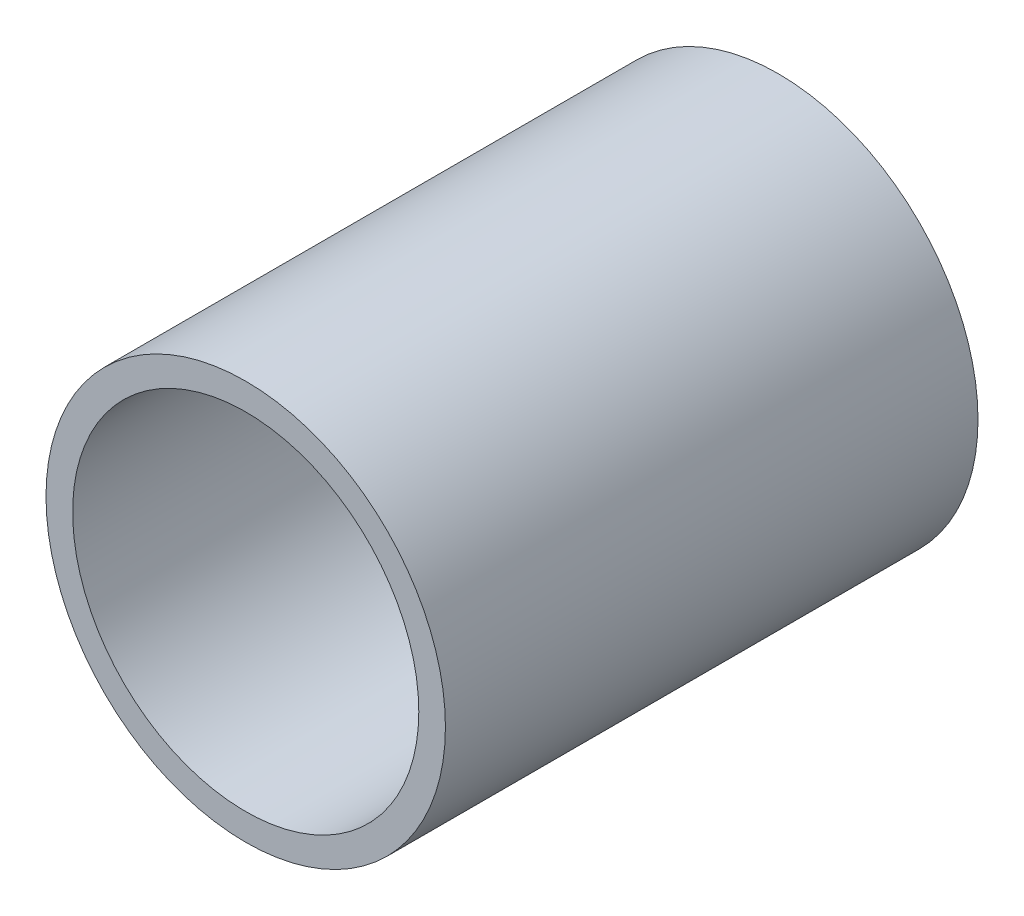
ISO-10303-21;
HEADER;
FILE_DESCRIPTION(('STEP AP214'),'2;1');
FILE_NAME('part.step','',(''),(''),'','','');
FILE_SCHEMA(('AUTOMOTIVE_DESIGN { 1 0 10303 214 1 1 1 1 }'));
ENDSEC;
DATA;
#1=APPLICATION_CONTEXT('core data for automotive mechanical design processes');
#2=APPLICATION_PROTOCOL_DEFINITION('international standard','automotive_design',2000,#1);
#3=PRODUCT_CONTEXT('',#1,'mechanical');
#4=PRODUCT('Part','Part','',(#3));
#5=PRODUCT_RELATED_PRODUCT_CATEGORY('part','',(#4));
#6=PRODUCT_DEFINITION_FORMATION('','',#4);
#7=PRODUCT_DEFINITION_CONTEXT('part definition',#1,'design');
#8=PRODUCT_DEFINITION('design','',#6,#7);
#9=PRODUCT_DEFINITION_SHAPE('','',#8);
#10=(LENGTH_UNIT() NAMED_UNIT(*) SI_UNIT(.MILLI.,.METRE.));
#11=(NAMED_UNIT(*) PLANE_ANGLE_UNIT() SI_UNIT($,.RADIAN.));
#12=(NAMED_UNIT(*) SI_UNIT($,.STERADIAN.) SOLID_ANGLE_UNIT());
#13=UNCERTAINTY_MEASURE_WITH_UNIT(LENGTH_MEASURE(1.E-05),#10,'distance_accuracy_value','');
#14=(GEOMETRIC_REPRESENTATION_CONTEXT(3) GLOBAL_UNCERTAINTY_ASSIGNED_CONTEXT((#13)) GLOBAL_UNIT_ASSIGNED_CONTEXT((#10,
#11,#12)) REPRESENTATION_CONTEXT('',''));
#15=CARTESIAN_POINT('',(0.,0.,0.));
#16=DIRECTION('',(0.,0.,1.));
#17=DIRECTION('',(1.,0.,0.));
#18=AXIS2_PLACEMENT_3D('',#15,#16,#17);
#19=CARTESIAN_POINT('',(0.,0.,20.));
#20=DIRECTION('',(0.,0.,1.));
#21=DIRECTION('',(1.,0.,0.));
#22=AXIS2_PLACEMENT_3D('',#19,#20,#21);
#23=PLANE('',#22);
#24=CARTESIAN_POINT('',(0.,0.,20.));
#25=DIRECTION('',(0.,0.,1.));
#26=DIRECTION('',(1.,0.,0.));
#27=AXIS2_PLACEMENT_3D('',#24,#25,#26);
#28=CIRCLE('',#27,7.5);
#29=CARTESIAN_POINT('',(7.5,0.,20.));
#30=VERTEX_POINT('',#29);
#31=EDGE_CURVE('E10',#30,#30,#28,.T.);
#32=ORIENTED_EDGE('',*,*,#31,.T.);
#33=EDGE_LOOP('',(#32));
#34=FACE_BOUND('',#33,.T.);
#35=CARTESIAN_POINT('',(0.,0.,20.));
#36=DIRECTION('',(0.,0.,1.));
#37=DIRECTION('',(1.,0.,0.));
#38=AXIS2_PLACEMENT_3D('',#35,#36,#37);
#39=CIRCLE('',#38,6.5);
#40=CARTESIAN_POINT('',(6.5,0.,20.));
#41=VERTEX_POINT('',#40);
#42=EDGE_CURVE('E41',#41,#41,#39,.T.);
#43=ORIENTED_EDGE('',*,*,#42,.F.);
#44=EDGE_LOOP('',(#43));
#45=FACE_BOUND('',#44,.T.);
#46=ADVANCED_FACE('F30',(#34,#45),#23,.T.);
#47=CARTESIAN_POINT('',(0.,0.,0.));
#48=DIRECTION('',(0.,0.,1.));
#49=DIRECTION('',(1.,0.,0.));
#50=AXIS2_PLACEMENT_3D('',#47,#48,#49);
#51=PLANE('',#50);
#52=CARTESIAN_POINT('',(0.,0.,0.));
#53=DIRECTION('',(0.,0.,1.));
#54=DIRECTION('',(1.,0.,0.));
#55=AXIS2_PLACEMENT_3D('',#52,#53,#54);
#56=CIRCLE('',#55,7.5);
#57=CARTESIAN_POINT('',(7.5,0.,0.));
#58=VERTEX_POINT('',#57);
#59=EDGE_CURVE('E34',#58,#58,#56,.T.);
#60=ORIENTED_EDGE('',*,*,#59,.F.);
#61=EDGE_LOOP('',(#60));
#62=FACE_BOUND('',#61,.T.);
#63=CARTESIAN_POINT('',(0.,0.,0.));
#64=DIRECTION('',(0.,0.,1.));
#65=DIRECTION('',(1.,0.,0.));
#66=AXIS2_PLACEMENT_3D('',#63,#64,#65);
#67=CIRCLE('',#66,6.5);
#68=CARTESIAN_POINT('',(6.5,0.,0.));
#69=VERTEX_POINT('',#68);
#70=EDGE_CURVE('E43',#69,#69,#67,.T.);
#71=ORIENTED_EDGE('',*,*,#70,.T.);
#72=EDGE_LOOP('',(#71));
#73=FACE_BOUND('',#72,.T.);
#74=ADVANCED_FACE('F53',(#62,#73),#51,.F.);
#75=CARTESIAN_POINT('',(0.,0.,20.));
#76=DIRECTION('',(0.,0.,-1.));
#77=DIRECTION('',(-1.,0.,0.));
#78=AXIS2_PLACEMENT_3D('',#75,#76,#77);
#79=CYLINDRICAL_SURFACE('',#78,7.5);
#80=ORIENTED_EDGE('',*,*,#31,.F.);
#81=EDGE_LOOP('',(#80));
#82=FACE_BOUND('',#81,.T.);
#83=ORIENTED_EDGE('',*,*,#59,.T.);
#84=EDGE_LOOP('',(#83));
#85=FACE_BOUND('',#84,.T.);
#86=ADVANCED_FACE('F32',(#82,#85),#79,.T.);
#87=CARTESIAN_POINT('',(0.,0.,20.));
#88=DIRECTION('',(0.,0.,-1.));
#89=DIRECTION('',(-1.,0.,0.));
#90=AXIS2_PLACEMENT_3D('',#87,#88,#89);
#91=CYLINDRICAL_SURFACE('',#90,6.5);
#92=ORIENTED_EDGE('',*,*,#42,.T.);
#93=EDGE_LOOP('',(#92));
#94=FACE_BOUND('',#93,.T.);
#95=ORIENTED_EDGE('',*,*,#70,.F.);
#96=EDGE_LOOP('',(#95));
#97=FACE_BOUND('',#96,.T.);
#98=ADVANCED_FACE('F49',(#94,#97),#91,.F.);
#99=CLOSED_SHELL('',(#46,#74,#86,#98));
#100=MANIFOLD_SOLID_BREP('B2',#99);
#101=ADVANCED_BREP_SHAPE_REPRESENTATION('',(#18,#100),#14);
#102=SHAPE_DEFINITION_REPRESENTATION(#9,#101);
ENDSEC;
END-ISO-10303-21;
